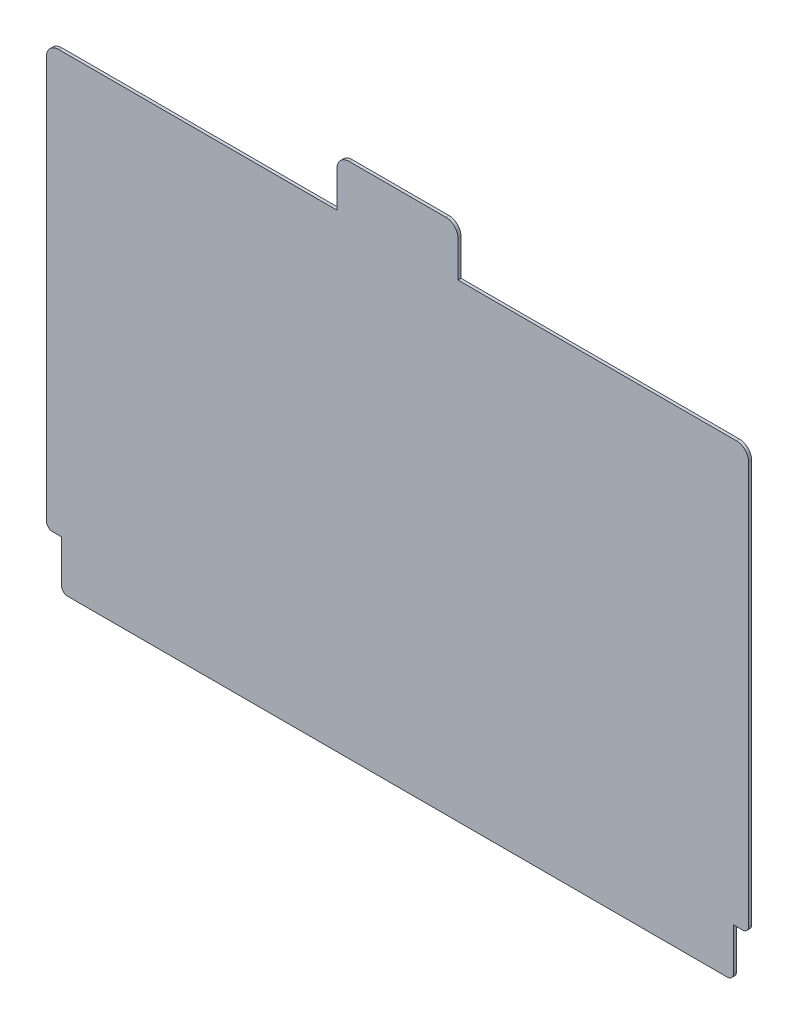
ISO-10303-21;
HEADER;
FILE_DESCRIPTION(('STEP AP214'),'2;1');
FILE_NAME('part.step','',(''),(''),'','','');
FILE_SCHEMA(('AUTOMOTIVE_DESIGN { 1 0 10303 214 1 1 1 1 }'));
ENDSEC;
DATA;
#1=APPLICATION_CONTEXT('core data for automotive mechanical design processes');
#2=APPLICATION_PROTOCOL_DEFINITION('international standard','automotive_design',2000,#1);
#3=PRODUCT_CONTEXT('',#1,'mechanical');
#4=PRODUCT('Part','Part','',(#3));
#5=PRODUCT_RELATED_PRODUCT_CATEGORY('part','',(#4));
#6=PRODUCT_DEFINITION_FORMATION('','',#4);
#7=PRODUCT_DEFINITION_CONTEXT('part definition',#1,'design');
#8=PRODUCT_DEFINITION('design','',#6,#7);
#9=PRODUCT_DEFINITION_SHAPE('','',#8);
#10=(LENGTH_UNIT() NAMED_UNIT(*) SI_UNIT(.MILLI.,.METRE.));
#11=(NAMED_UNIT(*) PLANE_ANGLE_UNIT() SI_UNIT($,.RADIAN.));
#12=(NAMED_UNIT(*) SI_UNIT($,.STERADIAN.) SOLID_ANGLE_UNIT());
#13=UNCERTAINTY_MEASURE_WITH_UNIT(LENGTH_MEASURE(1.E-05),#10,'distance_accuracy_value','');
#14=(GEOMETRIC_REPRESENTATION_CONTEXT(3) GLOBAL_UNCERTAINTY_ASSIGNED_CONTEXT((#13)) GLOBAL_UNIT_ASSIGNED_CONTEXT((#10,
#11,#12)) REPRESENTATION_CONTEXT('',''));
#15=CARTESIAN_POINT('',(0.,0.,0.));
#16=DIRECTION('',(0.,0.,1.));
#17=DIRECTION('',(1.,0.,0.));
#18=AXIS2_PLACEMENT_3D('',#15,#16,#17);
#19=CARTESIAN_POINT('',(887.338924574589,689.087920020209,0.79375));
#20=DIRECTION('',(1.,0.,0.));
#21=DIRECTION('',(0.,0.,-1.));
#22=AXIS2_PLACEMENT_3D('',#19,#20,#21);
#23=PLANE('',#22);
#24=DIRECTION('',(0.,-1.,0.));
#25=VECTOR('',#24,1.);
#26=CARTESIAN_POINT('',(887.338924574589,689.087920020209,0.));
#27=LINE('',#26,#25);
#28=CARTESIAN_POINT('',(887.338924574589,698.586284043289,0.));
#29=VERTEX_POINT('',#28);
#30=CARTESIAN_POINT('',(887.338924574589,689.087920020209,0.));
#31=VERTEX_POINT('',#30);
#32=EDGE_CURVE('E201',#29,#31,#27,.T.);
#33=ORIENTED_EDGE('',*,*,#32,.T.);
#34=DIRECTION('',(0.,0.,-1.));
#35=VECTOR('',#34,1.);
#36=CARTESIAN_POINT('',(887.338924574589,689.087920020209,0.79375));
#37=LINE('',#36,#35);
#38=CARTESIAN_POINT('',(887.338924574589,689.087920020209,0.79375));
#39=VERTEX_POINT('',#38);
#40=EDGE_CURVE('E11',#39,#31,#37,.T.);
#41=ORIENTED_EDGE('',*,*,#40,.F.);
#42=DIRECTION('',(0.,-1.,0.));
#43=VECTOR('',#42,1.);
#44=CARTESIAN_POINT('',(887.338924574589,689.087920020209,0.79375));
#45=LINE('',#44,#43);
#46=CARTESIAN_POINT('',(887.338924574589,698.586284043289,0.79375));
#47=VERTEX_POINT('',#46);
#48=EDGE_CURVE('E239',#47,#39,#45,.T.);
#49=ORIENTED_EDGE('',*,*,#48,.F.);
#50=DIRECTION('',(0.,0.,-1.));
#51=VECTOR('',#50,1.);
#52=CARTESIAN_POINT('',(887.338924574589,698.586284043289,0.79375));
#53=LINE('',#52,#51);
#54=EDGE_CURVE('E197',#47,#29,#53,.T.);
#55=ORIENTED_EDGE('',*,*,#54,.T.);
#56=EDGE_LOOP('',(#33,#41,#49,#55));
#57=FACE_BOUND('',#56,.T.);
#58=ADVANCED_FACE('F33',(#57),#23,.F.);
#59=CARTESIAN_POINT('',(814.313924574589,689.087920020209,0.79375));
#60=DIRECTION('',(0.,-1.,0.));
#61=DIRECTION('',(0.,0.,-1.));
#62=AXIS2_PLACEMENT_3D('',#59,#60,#61);
#63=PLANE('',#62);
#64=DIRECTION('',(-1.,0.,0.));
#65=VECTOR('',#64,1.);
#66=CARTESIAN_POINT('',(814.313924574589,689.087920020209,0.));
#67=LINE('',#66,#65);
#68=CARTESIAN_POINT('',(814.313924574589,689.087920020209,0.));
#69=VERTEX_POINT('',#68);
#70=EDGE_CURVE('E204',#31,#69,#67,.T.);
#71=ORIENTED_EDGE('',*,*,#70,.T.);
#72=DIRECTION('',(0.,0.,-1.));
#73=VECTOR('',#72,1.);
#74=CARTESIAN_POINT('',(814.313924574589,689.087920020209,0.79375));
#75=LINE('',#74,#73);
#76=CARTESIAN_POINT('',(814.313924574589,689.087920020209,0.79375));
#77=VERTEX_POINT('',#76);
#78=EDGE_CURVE('E41',#77,#69,#75,.T.);
#79=ORIENTED_EDGE('',*,*,#78,.F.);
#80=DIRECTION('',(-1.,0.,0.));
#81=VECTOR('',#80,1.);
#82=CARTESIAN_POINT('',(814.313924574589,689.087920020209,0.79375));
#83=LINE('',#82,#81);
#84=EDGE_CURVE('E128',#39,#77,#83,.T.);
#85=ORIENTED_EDGE('',*,*,#84,.F.);
#86=ORIENTED_EDGE('',*,*,#40,.T.);
#87=EDGE_LOOP('',(#71,#79,#85,#86));
#88=FACE_BOUND('',#87,.T.);
#89=ADVANCED_FACE('F357',(#88),#63,.F.);
#90=CARTESIAN_POINT('',(814.313924574589,685.912920020209,0.79375));
#91=DIRECTION('',(0.,0.,-1.));
#92=DIRECTION('',(-1.,0.,0.));
#93=AXIS2_PLACEMENT_3D('',#90,#91,#92);
#94=CYLINDRICAL_SURFACE('',#93,3.17500000000004);
#95=CARTESIAN_POINT('',(814.313924574589,685.912920020209,0.));
#96=DIRECTION('',(0.,0.,1.));
#97=DIRECTION('',(1.,0.,0.));
#98=AXIS2_PLACEMENT_3D('',#95,#96,#97);
#99=CIRCLE('',#98,3.17500000000004);
#100=CARTESIAN_POINT('',(811.138924574588,685.912920020209,0.));
#101=VERTEX_POINT('',#100);
#102=EDGE_CURVE('E206',#69,#101,#99,.T.);
#103=ORIENTED_EDGE('',*,*,#102,.T.);
#104=DIRECTION('',(0.,0.,-1.));
#105=VECTOR('',#104,1.);
#106=CARTESIAN_POINT('',(811.138924574588,685.912920020209,0.79375));
#107=LINE('',#106,#105);
#108=CARTESIAN_POINT('',(811.138924574588,685.912920020209,0.79375));
#109=VERTEX_POINT('',#108);
#110=EDGE_CURVE('E282',#109,#101,#107,.T.);
#111=ORIENTED_EDGE('',*,*,#110,.F.);
#112=CARTESIAN_POINT('',(814.313924574589,685.912920020209,0.79375));
#113=DIRECTION('',(0.,0.,1.));
#114=DIRECTION('',(1.,0.,0.));
#115=AXIS2_PLACEMENT_3D('',#112,#113,#114);
#116=CIRCLE('',#115,3.17500000000004);
#117=EDGE_CURVE('E290',#77,#109,#116,.T.);
#118=ORIENTED_EDGE('',*,*,#117,.F.);
#119=ORIENTED_EDGE('',*,*,#78,.T.);
#120=EDGE_LOOP('',(#103,#111,#118,#119));
#121=FACE_BOUND('',#120,.T.);
#122=ADVANCED_FACE('F288',(#121),#94,.T.);
#123=CARTESIAN_POINT('',(811.138924574588,685.912920020209,0.79375));
#124=DIRECTION('',(1.,0.,0.));
#125=DIRECTION('',(0.,0.,-1.));
#126=AXIS2_PLACEMENT_3D('',#123,#124,#125);
#127=PLANE('',#126);
#128=DIRECTION('',(0.,-1.,0.));
#129=VECTOR('',#128,1.);
#130=CARTESIAN_POINT('',(811.138924574588,685.912920020209,0.));
#131=LINE('',#130,#129);
#132=CARTESIAN_POINT('',(811.138924574588,580.344170020209,0.));
#133=VERTEX_POINT('',#132);
#134=EDGE_CURVE('E208',#101,#133,#131,.T.);
#135=ORIENTED_EDGE('',*,*,#134,.T.);
#136=DIRECTION('',(0.,0.,-1.));
#137=VECTOR('',#136,1.);
#138=CARTESIAN_POINT('',(811.138924574588,580.344170020209,0.79375));
#139=LINE('',#138,#137);
#140=CARTESIAN_POINT('',(811.138924574588,580.344170020209,0.79375));
#141=VERTEX_POINT('',#140);
#142=EDGE_CURVE('E279',#141,#133,#139,.T.);
#143=ORIENTED_EDGE('',*,*,#142,.F.);
#144=DIRECTION('',(0.,-1.,0.));
#145=VECTOR('',#144,1.);
#146=CARTESIAN_POINT('',(811.138924574588,685.912920020209,0.79375));
#147=LINE('',#146,#145);
#148=EDGE_CURVE('E308',#109,#141,#147,.T.);
#149=ORIENTED_EDGE('',*,*,#148,.F.);
#150=ORIENTED_EDGE('',*,*,#110,.T.);
#151=EDGE_LOOP('',(#135,#143,#149,#150));
#152=FACE_BOUND('',#151,.T.);
#153=ADVANCED_FACE('F299',(#152),#127,.F.);
#154=CARTESIAN_POINT('',(812.726424574588,580.344170020209,0.79375));
#155=DIRECTION('',(0.,0.,-1.));
#156=DIRECTION('',(-1.,0.,0.));
#157=AXIS2_PLACEMENT_3D('',#154,#155,#156);
#158=CYLINDRICAL_SURFACE('',#157,1.58749999999996);
#159=CARTESIAN_POINT('',(812.726424574588,580.344170020209,0.));
#160=DIRECTION('',(0.,0.,1.));
#161=DIRECTION('',(1.,0.,0.));
#162=AXIS2_PLACEMENT_3D('',#159,#160,#161);
#163=CIRCLE('',#162,1.58749999999996);
#164=CARTESIAN_POINT('',(812.726424574588,578.756670020209,0.));
#165=VERTEX_POINT('',#164);
#166=EDGE_CURVE('E210',#133,#165,#163,.T.);
#167=ORIENTED_EDGE('',*,*,#166,.T.);
#168=DIRECTION('',(0.,0.,-1.));
#169=VECTOR('',#168,1.);
#170=CARTESIAN_POINT('',(812.726424574588,578.756670020209,0.79375));
#171=LINE('',#170,#169);
#172=CARTESIAN_POINT('',(812.726424574588,578.756670020209,0.79375));
#173=VERTEX_POINT('',#172);
#174=EDGE_CURVE('E276',#173,#165,#171,.T.);
#175=ORIENTED_EDGE('',*,*,#174,.F.);
#176=CARTESIAN_POINT('',(812.726424574588,580.344170020209,0.79375));
#177=DIRECTION('',(0.,0.,1.));
#178=DIRECTION('',(1.,0.,0.));
#179=AXIS2_PLACEMENT_3D('',#176,#177,#178);
#180=CIRCLE('',#179,1.58749999999996);
#181=EDGE_CURVE('E305',#141,#173,#180,.T.);
#182=ORIENTED_EDGE('',*,*,#181,.F.);
#183=ORIENTED_EDGE('',*,*,#142,.T.);
#184=EDGE_LOOP('',(#167,#175,#182,#183));
#185=FACE_BOUND('',#184,.T.);
#186=ADVANCED_FACE('F303',(#185),#158,.T.);
#187=CARTESIAN_POINT('',(812.726424574588,578.756670020209,0.79375));
#188=DIRECTION('',(0.,1.,0.));
#189=DIRECTION('',(0.,0.,1.));
#190=AXIS2_PLACEMENT_3D('',#187,#188,#189);
#191=PLANE('',#190);
#192=DIRECTION('',(1.,0.,0.));
#193=VECTOR('',#192,1.);
#194=CARTESIAN_POINT('',(812.726424574588,578.756670020209,0.));
#195=LINE('',#194,#193);
#196=CARTESIAN_POINT('',(815.107674574589,578.756670020209,0.));
#197=VERTEX_POINT('',#196);
#198=EDGE_CURVE('E212',#165,#197,#195,.T.);
#199=ORIENTED_EDGE('',*,*,#198,.T.);
#200=DIRECTION('',(0.,0.,-1.));
#201=VECTOR('',#200,1.);
#202=CARTESIAN_POINT('',(815.107674574589,578.756670020209,0.79375));
#203=LINE('',#202,#201);
#204=CARTESIAN_POINT('',(815.107674574589,578.756670020209,0.79375));
#205=VERTEX_POINT('',#204);
#206=EDGE_CURVE('E273',#205,#197,#203,.T.);
#207=ORIENTED_EDGE('',*,*,#206,.F.);
#208=DIRECTION('',(1.,0.,0.));
#209=VECTOR('',#208,1.);
#210=CARTESIAN_POINT('',(812.726424574588,578.756670020209,0.79375));
#211=LINE('',#210,#209);
#212=EDGE_CURVE('E307',#173,#205,#211,.T.);
#213=ORIENTED_EDGE('',*,*,#212,.F.);
#214=ORIENTED_EDGE('',*,*,#174,.T.);
#215=EDGE_LOOP('',(#199,#207,#213,#214));
#216=FACE_BOUND('',#215,.T.);
#217=ADVANCED_FACE('F370',(#216),#191,.F.);
#218=CARTESIAN_POINT('',(815.107674574589,578.756670020209,0.79375));
#219=DIRECTION('',(1.,0.,0.));
#220=DIRECTION('',(0.,0.,-1.));
#221=AXIS2_PLACEMENT_3D('',#218,#219,#220);
#222=PLANE('',#221);
#223=DIRECTION('',(0.,-1.,0.));
#224=VECTOR('',#223,1.);
#225=CARTESIAN_POINT('',(815.107674574589,578.756670020209,0.));
#226=LINE('',#225,#224);
#227=CARTESIAN_POINT('',(815.107674574589,567.644170020209,0.));
#228=VERTEX_POINT('',#227);
#229=EDGE_CURVE('E214',#197,#228,#226,.T.);
#230=ORIENTED_EDGE('',*,*,#229,.T.);
#231=DIRECTION('',(0.,0.,-1.));
#232=VECTOR('',#231,1.);
#233=CARTESIAN_POINT('',(815.107674574589,567.644170020209,0.79375));
#234=LINE('',#233,#232);
#235=CARTESIAN_POINT('',(815.107674574589,567.644170020209,0.79375));
#236=VERTEX_POINT('',#235);
#237=EDGE_CURVE('E270',#236,#228,#234,.T.);
#238=ORIENTED_EDGE('',*,*,#237,.F.);
#239=DIRECTION('',(0.,-1.,0.));
#240=VECTOR('',#239,1.);
#241=CARTESIAN_POINT('',(815.107674574589,578.756670020209,0.79375));
#242=LINE('',#241,#240);
#243=EDGE_CURVE('E310',#205,#236,#242,.T.);
#244=ORIENTED_EDGE('',*,*,#243,.F.);
#245=ORIENTED_EDGE('',*,*,#206,.T.);
#246=EDGE_LOOP('',(#230,#238,#244,#245));
#247=FACE_BOUND('',#246,.T.);
#248=ADVANCED_FACE('F373',(#247),#222,.F.);
#249=CARTESIAN_POINT('',(816.695174574589,567.644170020209,0.79375));
#250=DIRECTION('',(0.,0.,-1.));
#251=DIRECTION('',(-1.,0.,0.));
#252=AXIS2_PLACEMENT_3D('',#249,#250,#251);
#253=CYLINDRICAL_SURFACE('',#252,1.58749999999996);
#254=CARTESIAN_POINT('',(816.695174574589,567.644170020209,0.));
#255=DIRECTION('',(0.,0.,1.));
#256=DIRECTION('',(1.,0.,0.));
#257=AXIS2_PLACEMENT_3D('',#254,#255,#256);
#258=CIRCLE('',#257,1.58749999999996);
#259=CARTESIAN_POINT('',(816.695174574589,566.056670020209,0.));
#260=VERTEX_POINT('',#259);
#261=EDGE_CURVE('E216',#228,#260,#258,.T.);
#262=ORIENTED_EDGE('',*,*,#261,.T.);
#263=DIRECTION('',(0.,0.,-1.));
#264=VECTOR('',#263,1.);
#265=CARTESIAN_POINT('',(816.695174574589,566.056670020209,0.79375));
#266=LINE('',#265,#264);
#267=CARTESIAN_POINT('',(816.695174574589,566.056670020209,0.79375));
#268=VERTEX_POINT('',#267);
#269=EDGE_CURVE('E267',#268,#260,#266,.T.);
#270=ORIENTED_EDGE('',*,*,#269,.F.);
#271=CARTESIAN_POINT('',(816.695174574589,567.644170020209,0.79375));
#272=DIRECTION('',(0.,0.,1.));
#273=DIRECTION('',(1.,0.,0.));
#274=AXIS2_PLACEMENT_3D('',#271,#272,#273);
#275=CIRCLE('',#274,1.58749999999996);
#276=EDGE_CURVE('E316',#236,#268,#275,.T.);
#277=ORIENTED_EDGE('',*,*,#276,.F.);
#278=ORIENTED_EDGE('',*,*,#237,.T.);
#279=EDGE_LOOP('',(#262,#270,#277,#278));
#280=FACE_BOUND('',#279,.T.);
#281=ADVANCED_FACE('F377',(#280),#253,.T.);
#282=CARTESIAN_POINT('',(816.695174574589,566.056670020209,0.79375));
#283=DIRECTION('',(0.,1.,0.));
#284=DIRECTION('',(-1.,0.,0.));
#285=AXIS2_PLACEMENT_3D('',#282,#283,#284);
#286=PLANE('',#285);
#287=DIRECTION('',(1.,0.,0.));
#288=VECTOR('',#287,1.);
#289=CARTESIAN_POINT('',(816.695174574589,566.056670020209,0.));
#290=LINE('',#289,#288);
#291=CARTESIAN_POINT('',(989.732674574589,566.056670020209,0.));
#292=VERTEX_POINT('',#291);
#293=EDGE_CURVE('E218',#260,#292,#290,.T.);
#294=ORIENTED_EDGE('',*,*,#293,.T.);
#295=DIRECTION('',(0.,0.,-1.));
#296=VECTOR('',#295,1.);
#297=CARTESIAN_POINT('',(989.732674574589,566.056670020209,0.79375));
#298=LINE('',#297,#296);
#299=CARTESIAN_POINT('',(989.732674574589,566.056670020209,0.79375));
#300=VERTEX_POINT('',#299);
#301=EDGE_CURVE('E264',#300,#292,#298,.T.);
#302=ORIENTED_EDGE('',*,*,#301,.F.);
#303=DIRECTION('',(1.,0.,0.));
#304=VECTOR('',#303,1.);
#305=CARTESIAN_POINT('',(816.695174574589,566.056670020209,0.79375));
#306=LINE('',#305,#304);
#307=EDGE_CURVE('E318',#268,#300,#306,.T.);
#308=ORIENTED_EDGE('',*,*,#307,.F.);
#309=ORIENTED_EDGE('',*,*,#269,.T.);
#310=EDGE_LOOP('',(#294,#302,#308,#309));
#311=FACE_BOUND('',#310,.T.);
#312=ADVANCED_FACE('F381',(#311),#286,.F.);
#313=CARTESIAN_POINT('',(989.732674574589,567.644170020209,0.79375));
#314=DIRECTION('',(0.,0.,-1.));
#315=DIRECTION('',(-1.,0.,0.));
#316=AXIS2_PLACEMENT_3D('',#313,#314,#315);
#317=CYLINDRICAL_SURFACE('',#316,1.58749999999991);
#318=CARTESIAN_POINT('',(989.732674574589,567.644170020209,0.));
#319=DIRECTION('',(0.,0.,1.));
#320=DIRECTION('',(1.,0.,0.));
#321=AXIS2_PLACEMENT_3D('',#318,#319,#320);
#322=CIRCLE('',#321,1.58749999999991);
#323=CARTESIAN_POINT('',(991.320174574589,567.644170020209,0.));
#324=VERTEX_POINT('',#323);
#325=EDGE_CURVE('E220',#292,#324,#322,.T.);
#326=ORIENTED_EDGE('',*,*,#325,.T.);
#327=DIRECTION('',(0.,0.,-1.));
#328=VECTOR('',#327,1.);
#329=CARTESIAN_POINT('',(991.320174574589,567.644170020209,0.79375));
#330=LINE('',#329,#328);
#331=CARTESIAN_POINT('',(991.320174574589,567.644170020209,0.79375));
#332=VERTEX_POINT('',#331);
#333=EDGE_CURVE('E261',#332,#324,#330,.T.);
#334=ORIENTED_EDGE('',*,*,#333,.F.);
#335=CARTESIAN_POINT('',(989.732674574589,567.644170020209,0.79375));
#336=DIRECTION('',(0.,0.,1.));
#337=DIRECTION('',(1.,0.,0.));
#338=AXIS2_PLACEMENT_3D('',#335,#336,#337);
#339=CIRCLE('',#338,1.58749999999991);
#340=EDGE_CURVE('E320',#300,#332,#339,.T.);
#341=ORIENTED_EDGE('',*,*,#340,.F.);
#342=ORIENTED_EDGE('',*,*,#301,.T.);
#343=EDGE_LOOP('',(#326,#334,#341,#342));
#344=FACE_BOUND('',#343,.T.);
#345=ADVANCED_FACE('F385',(#344),#317,.T.);
#346=CARTESIAN_POINT('',(991.320174574589,567.644170020209,0.79375));
#347=DIRECTION('',(-1.,0.,0.));
#348=DIRECTION('',(0.,0.,1.));
#349=AXIS2_PLACEMENT_3D('',#346,#347,#348);
#350=PLANE('',#349);
#351=DIRECTION('',(0.,1.,0.));
#352=VECTOR('',#351,1.);
#353=CARTESIAN_POINT('',(991.320174574589,567.644170020209,0.));
#354=LINE('',#353,#352);
#355=CARTESIAN_POINT('',(991.320174574589,578.756670020209,0.));
#356=VERTEX_POINT('',#355);
#357=EDGE_CURVE('E222',#324,#356,#354,.T.);
#358=ORIENTED_EDGE('',*,*,#357,.T.);
#359=DIRECTION('',(0.,0.,-1.));
#360=VECTOR('',#359,1.);
#361=CARTESIAN_POINT('',(991.320174574589,578.756670020209,0.79375));
#362=LINE('',#361,#360);
#363=CARTESIAN_POINT('',(991.320174574589,578.756670020209,0.79375));
#364=VERTEX_POINT('',#363);
#365=EDGE_CURVE('E258',#364,#356,#362,.T.);
#366=ORIENTED_EDGE('',*,*,#365,.F.);
#367=DIRECTION('',(0.,1.,0.));
#368=VECTOR('',#367,1.);
#369=CARTESIAN_POINT('',(991.320174574589,567.644170020209,0.79375));
#370=LINE('',#369,#368);
#371=EDGE_CURVE('E322',#332,#364,#370,.T.);
#372=ORIENTED_EDGE('',*,*,#371,.F.);
#373=ORIENTED_EDGE('',*,*,#333,.T.);
#374=EDGE_LOOP('',(#358,#366,#372,#373));
#375=FACE_BOUND('',#374,.T.);
#376=ADVANCED_FACE('F389',(#375),#350,.F.);
#377=CARTESIAN_POINT('',(991.320174574589,578.756670020209,0.79375));
#378=DIRECTION('',(0.,1.,0.));
#379=DIRECTION('',(0.,0.,1.));
#380=AXIS2_PLACEMENT_3D('',#377,#378,#379);
#381=PLANE('',#380);
#382=DIRECTION('',(1.,0.,0.));
#383=VECTOR('',#382,1.);
#384=CARTESIAN_POINT('',(991.320174574589,578.756670020209,0.));
#385=LINE('',#384,#383);
#386=CARTESIAN_POINT('',(993.701424574589,578.756670020209,0.));
#387=VERTEX_POINT('',#386);
#388=EDGE_CURVE('E224',#356,#387,#385,.T.);
#389=ORIENTED_EDGE('',*,*,#388,.T.);
#390=DIRECTION('',(0.,0.,-1.));
#391=VECTOR('',#390,1.);
#392=CARTESIAN_POINT('',(993.701424574589,578.756670020209,0.79375));
#393=LINE('',#392,#391);
#394=CARTESIAN_POINT('',(993.701424574589,578.756670020209,0.79375));
#395=VERTEX_POINT('',#394);
#396=EDGE_CURVE('E255',#395,#387,#393,.T.);
#397=ORIENTED_EDGE('',*,*,#396,.F.);
#398=DIRECTION('',(1.,0.,0.));
#399=VECTOR('',#398,1.);
#400=CARTESIAN_POINT('',(991.320174574589,578.756670020209,0.79375));
#401=LINE('',#400,#399);
#402=EDGE_CURVE('E324',#364,#395,#401,.T.);
#403=ORIENTED_EDGE('',*,*,#402,.F.);
#404=ORIENTED_EDGE('',*,*,#365,.T.);
#405=EDGE_LOOP('',(#389,#397,#403,#404));
#406=FACE_BOUND('',#405,.T.);
#407=ADVANCED_FACE('F393',(#406),#381,.F.);
#408=CARTESIAN_POINT('',(993.701424574589,580.344170020209,0.79375));
#409=DIRECTION('',(0.,0.,-1.));
#410=DIRECTION('',(-1.,0.,0.));
#411=AXIS2_PLACEMENT_3D('',#408,#409,#410);
#412=CYLINDRICAL_SURFACE('',#411,1.58749999999996);
#413=CARTESIAN_POINT('',(993.701424574589,580.344170020209,0.));
#414=DIRECTION('',(0.,0.,1.));
#415=DIRECTION('',(1.,0.,0.));
#416=AXIS2_PLACEMENT_3D('',#413,#414,#415);
#417=CIRCLE('',#416,1.58749999999996);
#418=CARTESIAN_POINT('',(995.288924574588,580.344170020209,0.));
#419=VERTEX_POINT('',#418);
#420=EDGE_CURVE('E226',#387,#419,#417,.T.);
#421=ORIENTED_EDGE('',*,*,#420,.T.);
#422=DIRECTION('',(0.,0.,-1.));
#423=VECTOR('',#422,1.);
#424=CARTESIAN_POINT('',(995.288924574588,580.344170020209,0.79375));
#425=LINE('',#424,#423);
#426=CARTESIAN_POINT('',(995.288924574588,580.344170020209,0.79375));
#427=VERTEX_POINT('',#426);
#428=EDGE_CURVE('E252',#427,#419,#425,.T.);
#429=ORIENTED_EDGE('',*,*,#428,.F.);
#430=CARTESIAN_POINT('',(993.701424574589,580.344170020209,0.79375));
#431=DIRECTION('',(0.,0.,1.));
#432=DIRECTION('',(1.,0.,0.));
#433=AXIS2_PLACEMENT_3D('',#430,#431,#432);
#434=CIRCLE('',#433,1.58749999999996);
#435=EDGE_CURVE('E326',#395,#427,#434,.T.);
#436=ORIENTED_EDGE('',*,*,#435,.F.);
#437=ORIENTED_EDGE('',*,*,#396,.T.);
#438=EDGE_LOOP('',(#421,#429,#436,#437));
#439=FACE_BOUND('',#438,.T.);
#440=ADVANCED_FACE('F397',(#439),#412,.T.);
#441=CARTESIAN_POINT('',(995.288924574588,580.344170020209,0.79375));
#442=DIRECTION('',(-1.,0.,0.));
#443=DIRECTION('',(0.,0.,1.));
#444=AXIS2_PLACEMENT_3D('',#441,#442,#443);
#445=PLANE('',#444);
#446=DIRECTION('',(0.,1.,0.));
#447=VECTOR('',#446,1.);
#448=CARTESIAN_POINT('',(995.288924574588,580.344170020209,0.));
#449=LINE('',#448,#447);
#450=CARTESIAN_POINT('',(995.288924574588,685.912920020209,0.));
#451=VERTEX_POINT('',#450);
#452=EDGE_CURVE('E228',#419,#451,#449,.T.);
#453=ORIENTED_EDGE('',*,*,#452,.T.);
#454=DIRECTION('',(0.,0.,-1.));
#455=VECTOR('',#454,1.);
#456=CARTESIAN_POINT('',(995.288924574588,685.912920020209,0.79375));
#457=LINE('',#456,#455);
#458=CARTESIAN_POINT('',(995.288924574588,685.912920020209,0.79375));
#459=VERTEX_POINT('',#458);
#460=EDGE_CURVE('E249',#459,#451,#457,.T.);
#461=ORIENTED_EDGE('',*,*,#460,.F.);
#462=DIRECTION('',(0.,1.,0.));
#463=VECTOR('',#462,1.);
#464=CARTESIAN_POINT('',(995.288924574588,580.344170020209,0.79375));
#465=LINE('',#464,#463);
#466=EDGE_CURVE('E328',#427,#459,#465,.T.);
#467=ORIENTED_EDGE('',*,*,#466,.F.);
#468=ORIENTED_EDGE('',*,*,#428,.T.);
#469=EDGE_LOOP('',(#453,#461,#467,#468));
#470=FACE_BOUND('',#469,.T.);
#471=ADVANCED_FACE('F401',(#470),#445,.F.);
#472=CARTESIAN_POINT('',(992.113924574589,685.912920020209,0.79375));
#473=DIRECTION('',(0.,0.,-1.));
#474=DIRECTION('',(-1.,0.,0.));
#475=AXIS2_PLACEMENT_3D('',#472,#473,#474);
#476=CYLINDRICAL_SURFACE('',#475,3.17500000000004);
#477=CARTESIAN_POINT('',(992.113924574589,685.912920020209,0.));
#478=DIRECTION('',(0.,0.,1.));
#479=DIRECTION('',(1.,0.,0.));
#480=AXIS2_PLACEMENT_3D('',#477,#478,#479);
#481=CIRCLE('',#480,3.17500000000004);
#482=CARTESIAN_POINT('',(992.113924574589,689.087920020209,0.));
#483=VERTEX_POINT('',#482);
#484=EDGE_CURVE('E230',#451,#483,#481,.T.);
#485=ORIENTED_EDGE('',*,*,#484,.T.);
#486=DIRECTION('',(0.,0.,-1.));
#487=VECTOR('',#486,1.);
#488=CARTESIAN_POINT('',(992.113924574589,689.087920020209,0.79375));
#489=LINE('',#488,#487);
#490=CARTESIAN_POINT('',(992.113924574589,689.087920020209,0.79375));
#491=VERTEX_POINT('',#490);
#492=EDGE_CURVE('E246',#491,#483,#489,.T.);
#493=ORIENTED_EDGE('',*,*,#492,.F.);
#494=CARTESIAN_POINT('',(992.113924574589,685.912920020209,0.79375));
#495=DIRECTION('',(0.,0.,1.));
#496=DIRECTION('',(1.,0.,0.));
#497=AXIS2_PLACEMENT_3D('',#494,#495,#496);
#498=CIRCLE('',#497,3.17500000000004);
#499=EDGE_CURVE('E330',#459,#491,#498,.T.);
#500=ORIENTED_EDGE('',*,*,#499,.F.);
#501=ORIENTED_EDGE('',*,*,#460,.T.);
#502=EDGE_LOOP('',(#485,#493,#500,#501));
#503=FACE_BOUND('',#502,.T.);
#504=ADVANCED_FACE('F405',(#503),#476,.T.);
#505=CARTESIAN_POINT('',(992.113924574589,689.087920020209,0.79375));
#506=DIRECTION('',(0.,-1.,0.));
#507=DIRECTION('',(0.,0.,-1.));
#508=AXIS2_PLACEMENT_3D('',#505,#506,#507);
#509=PLANE('',#508);
#510=DIRECTION('',(-1.,0.,0.));
#511=VECTOR('',#510,1.);
#512=CARTESIAN_POINT('',(992.113924574589,689.087920020209,0.));
#513=LINE('',#512,#511);
#514=CARTESIAN_POINT('',(919.088924574588,689.087920020209,0.));
#515=VERTEX_POINT('',#514);
#516=EDGE_CURVE('E232',#483,#515,#513,.T.);
#517=ORIENTED_EDGE('',*,*,#516,.T.);
#518=DIRECTION('',(0.,0.,-1.));
#519=VECTOR('',#518,1.);
#520=CARTESIAN_POINT('',(919.088924574588,689.087920020209,0.79375));
#521=LINE('',#520,#519);
#522=CARTESIAN_POINT('',(919.088924574588,689.087920020209,0.79375));
#523=VERTEX_POINT('',#522);
#524=EDGE_CURVE('E243',#523,#515,#521,.T.);
#525=ORIENTED_EDGE('',*,*,#524,.F.);
#526=DIRECTION('',(-1.,0.,0.));
#527=VECTOR('',#526,1.);
#528=CARTESIAN_POINT('',(992.113924574589,689.087920020209,0.79375));
#529=LINE('',#528,#527);
#530=EDGE_CURVE('E332',#491,#523,#529,.T.);
#531=ORIENTED_EDGE('',*,*,#530,.F.);
#532=ORIENTED_EDGE('',*,*,#492,.T.);
#533=EDGE_LOOP('',(#517,#525,#531,#532));
#534=FACE_BOUND('',#533,.T.);
#535=ADVANCED_FACE('F338',(#534),#509,.F.);
#536=CARTESIAN_POINT('',(919.088924574588,698.586284043289,0.79375));
#537=DIRECTION('',(-1.,0.,0.));
#538=DIRECTION('',(0.,0.,1.));
#539=AXIS2_PLACEMENT_3D('',#536,#537,#538);
#540=PLANE('',#539);
#541=DIRECTION('',(0.,1.,0.));
#542=VECTOR('',#541,1.);
#543=CARTESIAN_POINT('',(919.088924574588,698.586284043289,0.));
#544=LINE('',#543,#542);
#545=CARTESIAN_POINT('',(919.088924574588,698.586284043289,0.));
#546=VERTEX_POINT('',#545);
#547=EDGE_CURVE('E234',#515,#546,#544,.T.);
#548=ORIENTED_EDGE('',*,*,#547,.T.);
#549=DIRECTION('',(0.,0.,-1.));
#550=VECTOR('',#549,1.);
#551=CARTESIAN_POINT('',(919.088924574588,698.586284043289,0.79375));
#552=LINE('',#551,#550);
#553=CARTESIAN_POINT('',(919.088924574588,698.586284043289,0.79375));
#554=VERTEX_POINT('',#553);
#555=EDGE_CURVE('E192',#554,#546,#552,.T.);
#556=ORIENTED_EDGE('',*,*,#555,.F.);
#557=DIRECTION('',(0.,1.,0.));
#558=VECTOR('',#557,1.);
#559=CARTESIAN_POINT('',(919.088924574588,698.586284043289,0.79375));
#560=LINE('',#559,#558);
#561=EDGE_CURVE('E183',#523,#554,#560,.T.);
#562=ORIENTED_EDGE('',*,*,#561,.F.);
#563=ORIENTED_EDGE('',*,*,#524,.T.);
#564=EDGE_LOOP('',(#548,#556,#562,#563));
#565=FACE_BOUND('',#564,.T.);
#566=ADVANCED_FACE('F342',(#565),#540,.F.);
#567=CARTESIAN_POINT('',(915.913924574588,698.586284043289,0.79375));
#568=DIRECTION('',(0.,0.,-1.));
#569=DIRECTION('',(-1.,0.,0.));
#570=AXIS2_PLACEMENT_3D('',#567,#568,#569);
#571=CYLINDRICAL_SURFACE('',#570,3.17500000000004);
#572=CARTESIAN_POINT('',(915.913924574588,698.586284043289,0.));
#573=DIRECTION('',(0.,0.,1.));
#574=DIRECTION('',(-1.,0.,0.));
#575=AXIS2_PLACEMENT_3D('',#572,#573,#574);
#576=CIRCLE('',#575,3.17500000000004);
#577=CARTESIAN_POINT('',(915.913924574588,701.761284043289,0.));
#578=VERTEX_POINT('',#577);
#579=EDGE_CURVE('E191',#546,#578,#576,.T.);
#580=ORIENTED_EDGE('',*,*,#579,.T.);
#581=DIRECTION('',(0.,0.,-1.));
#582=VECTOR('',#581,1.);
#583=CARTESIAN_POINT('',(915.913924574588,701.761284043289,0.79375));
#584=LINE('',#583,#582);
#585=CARTESIAN_POINT('',(915.913924574588,701.761284043289,0.79375));
#586=VERTEX_POINT('',#585);
#587=EDGE_CURVE('E188',#586,#578,#584,.T.);
#588=ORIENTED_EDGE('',*,*,#587,.F.);
#589=CARTESIAN_POINT('',(915.913924574588,698.586284043289,0.79375));
#590=DIRECTION('',(0.,0.,1.));
#591=DIRECTION('',(-1.,0.,0.));
#592=AXIS2_PLACEMENT_3D('',#589,#590,#591);
#593=CIRCLE('',#592,3.17500000000004);
#594=EDGE_CURVE('E177',#554,#586,#593,.T.);
#595=ORIENTED_EDGE('',*,*,#594,.F.);
#596=ORIENTED_EDGE('',*,*,#555,.T.);
#597=EDGE_LOOP('',(#580,#588,#595,#596));
#598=FACE_BOUND('',#597,.T.);
#599=ADVANCED_FACE('F189',(#598),#571,.T.);
#600=CARTESIAN_POINT('',(890.513924574589,701.761284043289,0.79375));
#601=DIRECTION('',(0.,-1.,0.));
#602=DIRECTION('',(0.,0.,-1.));
#603=AXIS2_PLACEMENT_3D('',#600,#601,#602);
#604=PLANE('',#603);
#605=DIRECTION('',(-1.,0.,0.));
#606=VECTOR('',#605,1.);
#607=CARTESIAN_POINT('',(890.513924574589,701.761284043289,0.));
#608=LINE('',#607,#606);
#609=CARTESIAN_POINT('',(890.513924574589,701.761284043289,0.));
#610=VERTEX_POINT('',#609);
#611=EDGE_CURVE('E114',#578,#610,#608,.T.);
#612=ORIENTED_EDGE('',*,*,#611,.T.);
#613=DIRECTION('',(0.,0.,-1.));
#614=VECTOR('',#613,1.);
#615=CARTESIAN_POINT('',(890.513924574589,701.761284043289,0.79375));
#616=LINE('',#615,#614);
#617=CARTESIAN_POINT('',(890.513924574589,701.761284043289,0.79375));
#618=VERTEX_POINT('',#617);
#619=EDGE_CURVE('E193',#618,#610,#616,.T.);
#620=ORIENTED_EDGE('',*,*,#619,.F.);
#621=DIRECTION('',(-1.,0.,0.));
#622=VECTOR('',#621,1.);
#623=CARTESIAN_POINT('',(890.513924574589,701.761284043289,0.79375));
#624=LINE('',#623,#622);
#625=EDGE_CURVE('E181',#586,#618,#624,.T.);
#626=ORIENTED_EDGE('',*,*,#625,.F.);
#627=ORIENTED_EDGE('',*,*,#587,.T.);
#628=EDGE_LOOP('',(#612,#620,#626,#627));
#629=FACE_BOUND('',#628,.T.);
#630=ADVANCED_FACE('F195',(#629),#604,.F.);
#631=CARTESIAN_POINT('',(890.513924574589,698.586284043289,0.79375));
#632=DIRECTION('',(0.,0.,-1.));
#633=DIRECTION('',(-1.,0.,0.));
#634=AXIS2_PLACEMENT_3D('',#631,#632,#633);
#635=CYLINDRICAL_SURFACE('',#634,3.17500000000004);
#636=CARTESIAN_POINT('',(890.513924574589,698.586284043289,0.));
#637=DIRECTION('',(0.,0.,1.));
#638=DIRECTION('',(-1.,0.,0.));
#639=AXIS2_PLACEMENT_3D('',#636,#637,#638);
#640=CIRCLE('',#639,3.17500000000004);
#641=EDGE_CURVE('E120',#610,#29,#640,.T.);
#642=ORIENTED_EDGE('',*,*,#641,.T.);
#643=ORIENTED_EDGE('',*,*,#54,.F.);
#644=CARTESIAN_POINT('',(890.513924574589,698.586284043289,0.79375));
#645=DIRECTION('',(0.,0.,1.));
#646=DIRECTION('',(-1.,0.,0.));
#647=AXIS2_PLACEMENT_3D('',#644,#645,#646);
#648=CIRCLE('',#647,3.17500000000004);
#649=EDGE_CURVE('E49',#618,#47,#648,.T.);
#650=ORIENTED_EDGE('',*,*,#649,.F.);
#651=ORIENTED_EDGE('',*,*,#619,.T.);
#652=EDGE_LOOP('',(#642,#643,#650,#651));
#653=FACE_BOUND('',#652,.T.);
#654=ADVANCED_FACE('F346',(#653),#635,.T.);
#655=CARTESIAN_POINT('',(890.513924574589,698.586284043289,0.79375));
#656=DIRECTION('',(0.,0.,-1.));
#657=DIRECTION('',(-1.,0.,0.));
#658=AXIS2_PLACEMENT_3D('',#655,#656,#657);
#659=PLANE('',#658);
#660=ORIENTED_EDGE('',*,*,#48,.T.);
#661=ORIENTED_EDGE('',*,*,#84,.T.);
#662=ORIENTED_EDGE('',*,*,#117,.T.);
#663=ORIENTED_EDGE('',*,*,#148,.T.);
#664=ORIENTED_EDGE('',*,*,#181,.T.);
#665=ORIENTED_EDGE('',*,*,#212,.T.);
#666=ORIENTED_EDGE('',*,*,#243,.T.);
#667=ORIENTED_EDGE('',*,*,#276,.T.);
#668=ORIENTED_EDGE('',*,*,#307,.T.);
#669=ORIENTED_EDGE('',*,*,#340,.T.);
#670=ORIENTED_EDGE('',*,*,#371,.T.);
#671=ORIENTED_EDGE('',*,*,#402,.T.);
#672=ORIENTED_EDGE('',*,*,#435,.T.);
#673=ORIENTED_EDGE('',*,*,#466,.T.);
#674=ORIENTED_EDGE('',*,*,#499,.T.);
#675=ORIENTED_EDGE('',*,*,#530,.T.);
#676=ORIENTED_EDGE('',*,*,#561,.T.);
#677=ORIENTED_EDGE('',*,*,#594,.T.);
#678=ORIENTED_EDGE('',*,*,#625,.T.);
#679=ORIENTED_EDGE('',*,*,#649,.T.);
#680=EDGE_LOOP('',(#660,#661,#662,#663,#664,#665,#666,#667,#668,#669,#670,#671,#672,#673,#674,
#675,#676,#677,#678,#679));
#681=FACE_BOUND('',#680,.T.);
#682=ADVANCED_FACE('F179',(#681),#659,.F.);
#683=CARTESIAN_POINT('',(890.513924574589,698.586284043289,0.));
#684=DIRECTION('',(0.,0.,-1.));
#685=DIRECTION('',(-1.,0.,0.));
#686=AXIS2_PLACEMENT_3D('',#683,#684,#685);
#687=PLANE('',#686);
#688=ORIENTED_EDGE('',*,*,#32,.F.);
#689=ORIENTED_EDGE('',*,*,#641,.F.);
#690=ORIENTED_EDGE('',*,*,#611,.F.);
#691=ORIENTED_EDGE('',*,*,#579,.F.);
#692=ORIENTED_EDGE('',*,*,#547,.F.);
#693=ORIENTED_EDGE('',*,*,#516,.F.);
#694=ORIENTED_EDGE('',*,*,#484,.F.);
#695=ORIENTED_EDGE('',*,*,#452,.F.);
#696=ORIENTED_EDGE('',*,*,#420,.F.);
#697=ORIENTED_EDGE('',*,*,#388,.F.);
#698=ORIENTED_EDGE('',*,*,#357,.F.);
#699=ORIENTED_EDGE('',*,*,#325,.F.);
#700=ORIENTED_EDGE('',*,*,#293,.F.);
#701=ORIENTED_EDGE('',*,*,#261,.F.);
#702=ORIENTED_EDGE('',*,*,#229,.F.);
#703=ORIENTED_EDGE('',*,*,#198,.F.);
#704=ORIENTED_EDGE('',*,*,#166,.F.);
#705=ORIENTED_EDGE('',*,*,#134,.F.);
#706=ORIENTED_EDGE('',*,*,#102,.F.);
#707=ORIENTED_EDGE('',*,*,#70,.F.);
#708=EDGE_LOOP('',(#688,#689,#690,#691,#692,#693,#694,#695,#696,#697,#698,#699,#700,#701,#702,
#703,#704,#705,#706,#707));
#709=FACE_BOUND('',#708,.T.);
#710=ADVANCED_FACE('F294',(#709),#687,.T.);
#711=CLOSED_SHELL('',(#58,#89,#122,#153,#186,#217,#248,#281,#312,#345,#376,#407,#440,#471,#504,
#535,#566,#599,#630,#654,#682,#710));
#712=MANIFOLD_SOLID_BREP('B2',#711);
#713=ADVANCED_BREP_SHAPE_REPRESENTATION('',(#18,#712),#14);
#714=SHAPE_DEFINITION_REPRESENTATION(#9,#713);
ENDSEC;
END-ISO-10303-21;
